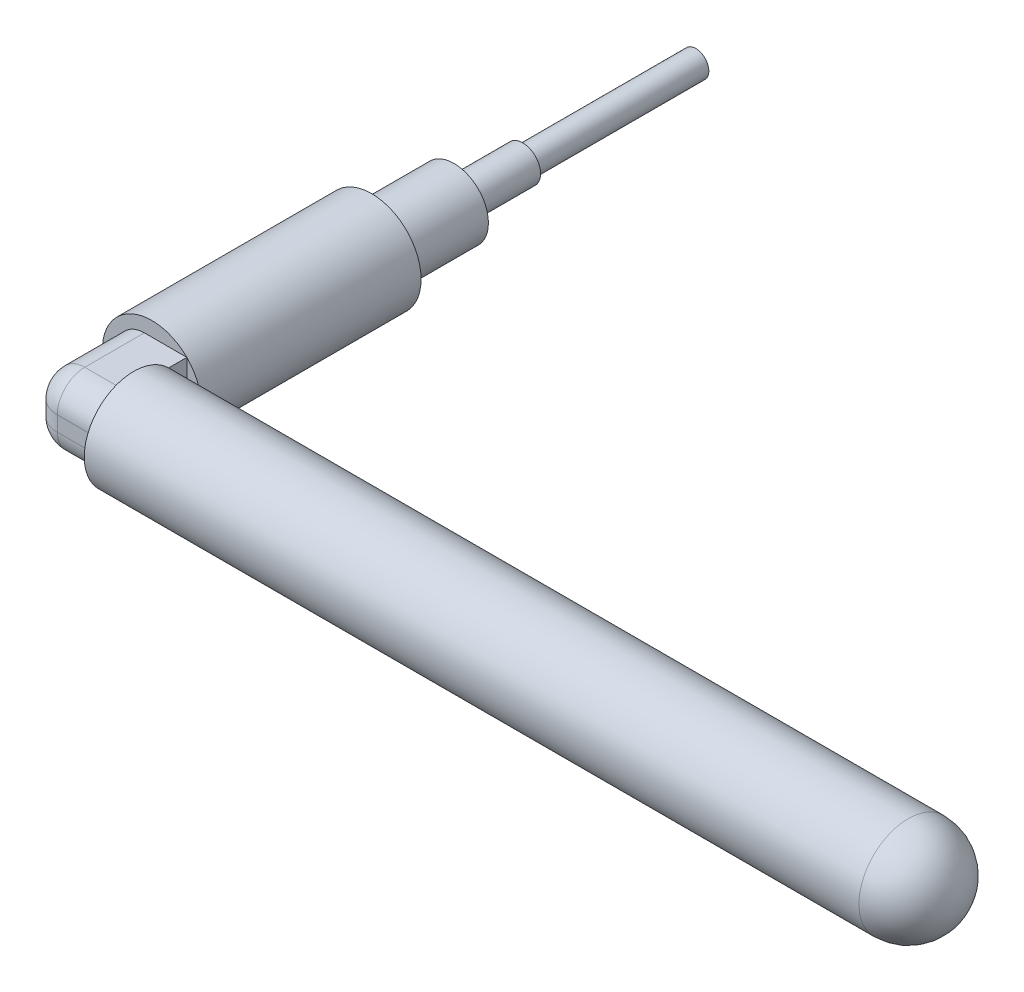
ISO-10303-21;
HEADER;
FILE_DESCRIPTION(('STEP AP214'),'2;1');
FILE_NAME('part.step','',(''),(''),'','','');
FILE_SCHEMA(('AUTOMOTIVE_DESIGN { 1 0 10303 214 1 1 1 1 }'));
ENDSEC;
DATA;
#1=APPLICATION_CONTEXT('core data for automotive mechanical design processes');
#2=APPLICATION_PROTOCOL_DEFINITION('international standard','automotive_design',2000,#1);
#3=PRODUCT_CONTEXT('',#1,'mechanical');
#4=PRODUCT('Part','Part','',(#3));
#5=PRODUCT_RELATED_PRODUCT_CATEGORY('part','',(#4));
#6=PRODUCT_DEFINITION_FORMATION('','',#4);
#7=PRODUCT_DEFINITION_CONTEXT('part definition',#1,'design');
#8=PRODUCT_DEFINITION('design','',#6,#7);
#9=PRODUCT_DEFINITION_SHAPE('','',#8);
#10=(LENGTH_UNIT() NAMED_UNIT(*) SI_UNIT(.MILLI.,.METRE.));
#11=(NAMED_UNIT(*) PLANE_ANGLE_UNIT() SI_UNIT($,.RADIAN.));
#12=(NAMED_UNIT(*) SI_UNIT($,.STERADIAN.) SOLID_ANGLE_UNIT());
#13=UNCERTAINTY_MEASURE_WITH_UNIT(LENGTH_MEASURE(1.E-05),#10,'distance_accuracy_value','');
#14=(GEOMETRIC_REPRESENTATION_CONTEXT(3) GLOBAL_UNCERTAINTY_ASSIGNED_CONTEXT((#13)) GLOBAL_UNIT_ASSIGNED_CONTEXT((#10,
#11,#12)) REPRESENTATION_CONTEXT('',''));
#15=CARTESIAN_POINT('',(0.,0.,0.));
#16=DIRECTION('',(0.,0.,1.));
#17=DIRECTION('',(1.,0.,0.));
#18=AXIS2_PLACEMENT_3D('',#15,#16,#17);
#19=CARTESIAN_POINT('',(3.23289220358494,-3.23289220358492,28.3718));
#20=DIRECTION('',(-1.,0.,0.));
#21=DIRECTION('',(0.,-1.,0.));
#22=AXIS2_PLACEMENT_3D('',#19,#20,#21);
#23=PLANE('',#22);
#24=CARTESIAN_POINT('',(3.23289220358492,0.,25.2349));
#25=DIRECTION('',(1.,0.,0.));
#26=DIRECTION('',(0.,1.,0.));
#27=AXIS2_PLACEMENT_3D('',#24,#25,#26);
#28=CIRCLE('',#27,4.572);
#29=CARTESIAN_POINT('',(3.23289220358494,-3.23289220358492,22.0020077964152));
#30=VERTEX_POINT('',#29);
#31=CARTESIAN_POINT('',(3.2328922035849,3.23289220358492,22.0020077964151));
#32=VERTEX_POINT('',#31);
#33=EDGE_CURVE('E128',#30,#32,#28,.T.);
#34=ORIENTED_EDGE('',*,*,#33,.F.);
#35=DIRECTION('',(0.,0.,-1.));
#36=VECTOR('',#35,1.);
#37=CARTESIAN_POINT('',(3.23289220358494,-3.23289220358492,28.3718));
#38=LINE('',#37,#36);
#39=CARTESIAN_POINT('',(3.23289220358487,-3.23289220358492,20.32));
#40=VERTEX_POINT('',#39);
#41=EDGE_CURVE('E123',#30,#40,#38,.T.);
#42=ORIENTED_EDGE('',*,*,#41,.T.);
#43=DIRECTION('',(0.,1.,0.));
#44=VECTOR('',#43,1.);
#45=CARTESIAN_POINT('',(3.23289220358494,-3.23289220358492,20.32));
#46=LINE('',#45,#44);
#47=CARTESIAN_POINT('',(3.23289220358487,3.23289220358492,20.32));
#48=VERTEX_POINT('',#47);
#49=EDGE_CURVE('E175',#40,#48,#46,.T.);
#50=ORIENTED_EDGE('',*,*,#49,.T.);
#51=DIRECTION('',(0.,0.,-1.));
#52=VECTOR('',#51,1.);
#53=CARTESIAN_POINT('',(3.2328922035849,3.23289220358492,28.3718));
#54=LINE('',#53,#52);
#55=EDGE_CURVE('E122',#32,#48,#54,.T.);
#56=ORIENTED_EDGE('',*,*,#55,.F.);
#57=EDGE_LOOP('',(#34,#42,#50,#56));
#58=FACE_BOUND('',#57,.T.);
#59=ADVANCED_FACE('F33',(#58),#23,.F.);
#60=CARTESIAN_POINT('',(0.,0.,20.32));
#61=DIRECTION('',(0.,0.,1.));
#62=DIRECTION('',(1.,0.,0.));
#63=AXIS2_PLACEMENT_3D('',#60,#61,#62);
#64=PLANE('',#63);
#65=ORIENTED_EDGE('',*,*,#49,.F.);
#66=CARTESIAN_POINT('',(0.,0.,20.32));
#67=DIRECTION('',(0.,0.,1.));
#68=DIRECTION('',(1.,0.,0.));
#69=AXIS2_PLACEMENT_3D('',#66,#67,#68);
#70=CIRCLE('',#69,4.572);
#71=EDGE_CURVE('E167',#40,#48,#70,.T.);
#72=ORIENTED_EDGE('',*,*,#71,.T.);
#73=EDGE_LOOP('',(#65,#72));
#74=FACE_BOUND('',#73,.T.);
#75=ADVANCED_FACE('F248',(#74),#64,.T.);
#76=DIRECTION('',(1.,0.,0.));
#77=VECTOR('',#76,1.);
#78=CARTESIAN_POINT('',(3.23289220358494,-3.23289220358492,20.32));
#79=LINE('',#78,#77);
#80=CARTESIAN_POINT('',(-0.692892203584919,-3.2328922035849,20.32));
#81=VERTEX_POINT('',#80);
#82=EDGE_CURVE('E138',#81,#40,#79,.T.);
#83=ORIENTED_EDGE('',*,*,#82,.F.);
#84=CARTESIAN_POINT('',(-0.692892203584903,-0.692892203584898,20.32));
#85=DIRECTION('',(0.,0.,1.));
#86=DIRECTION('',(1.,0.,0.));
#87=AXIS2_PLACEMENT_3D('',#84,#85,#86);
#88=CIRCLE('',#87,2.54);
#89=CARTESIAN_POINT('',(-3.2328922035849,-0.692892203584894,20.32));
#90=VERTEX_POINT('',#89);
#91=EDGE_CURVE('E197',#81,#90,#88,.F.);
#92=ORIENTED_EDGE('',*,*,#91,.T.);
#93=DIRECTION('',(0.,-1.,0.));
#94=VECTOR('',#93,1.);
#95=CARTESIAN_POINT('',(-3.23289220358491,-3.23289220358488,20.32));
#96=LINE('',#95,#94);
#97=CARTESIAN_POINT('',(-3.2328922035849,0.6928922035849,20.32));
#98=VERTEX_POINT('',#97);
#99=EDGE_CURVE('E58',#98,#90,#96,.T.);
#100=ORIENTED_EDGE('',*,*,#99,.F.);
#101=CARTESIAN_POINT('',(-0.692892203584901,0.692892203584898,20.32));
#102=DIRECTION('',(0.,0.,1.));
#103=DIRECTION('',(1.,0.,0.));
#104=AXIS2_PLACEMENT_3D('',#101,#102,#103);
#105=CIRCLE('',#104,2.54);
#106=CARTESIAN_POINT('',(-0.692892203584915,3.2328922035849,20.32));
#107=VERTEX_POINT('',#106);
#108=EDGE_CURVE('E42',#98,#107,#105,.F.);
#109=ORIENTED_EDGE('',*,*,#108,.T.);
#110=DIRECTION('',(-1.,0.,0.));
#111=VECTOR('',#110,1.);
#112=CARTESIAN_POINT('',(3.2328922035849,3.23289220358492,20.32));
#113=LINE('',#112,#111);
#114=EDGE_CURVE('E50',#48,#107,#113,.T.);
#115=ORIENTED_EDGE('',*,*,#114,.F.);
#116=CARTESIAN_POINT('',(-3.2328922035849,3.23289220358488,20.32));
#117=VERTEX_POINT('',#116);
#118=EDGE_CURVE('E163',#48,#117,#70,.T.);
#119=ORIENTED_EDGE('',*,*,#118,.T.);
#120=CARTESIAN_POINT('',(-3.23289220358491,-3.23289220358488,20.32));
#121=VERTEX_POINT('',#120);
#122=EDGE_CURVE('E166',#117,#121,#70,.T.);
#123=ORIENTED_EDGE('',*,*,#122,.T.);
#124=EDGE_CURVE('E255',#121,#40,#70,.T.);
#125=ORIENTED_EDGE('',*,*,#124,.T.);
#126=EDGE_LOOP('',(#83,#92,#100,#109,#115,#119,#123,#125));
#127=FACE_BOUND('',#126,.T.);
#128=ADVANCED_FACE('F240',(#127),#64,.T.);
#129=CARTESIAN_POINT('',(0.,0.,-13.97));
#130=DIRECTION('',(0.,0.,-1.));
#131=DIRECTION('',(-1.,0.,0.));
#132=AXIS2_PLACEMENT_3D('',#129,#130,#131);
#133=PLANE('',#132);
#134=CARTESIAN_POINT('',(0.,0.,-13.97));
#135=DIRECTION('',(0.,0.,-1.));
#136=DIRECTION('',(-1.,0.,0.));
#137=AXIS2_PLACEMENT_3D('',#134,#135,#136);
#138=CIRCLE('',#137,1.651);
#139=CARTESIAN_POINT('',(-1.651,0.,-13.97));
#140=VERTEX_POINT('',#139);
#141=EDGE_CURVE('E154',#140,#140,#138,.T.);
#142=ORIENTED_EDGE('',*,*,#141,.T.);
#143=EDGE_LOOP('',(#142));
#144=FACE_BOUND('',#143,.T.);
#145=CARTESIAN_POINT('',(0.,0.,-13.97));
#146=DIRECTION('',(0.,0.,-1.));
#147=DIRECTION('',(-1.,0.,0.));
#148=AXIS2_PLACEMENT_3D('',#145,#146,#147);
#149=CIRCLE('',#148,1.2065);
#150=CARTESIAN_POINT('',(-1.2065,0.,-13.97));
#151=VERTEX_POINT('',#150);
#152=EDGE_CURVE('E147',#151,#151,#149,.T.);
#153=ORIENTED_EDGE('',*,*,#152,.F.);
#154=EDGE_LOOP('',(#153));
#155=FACE_BOUND('',#154,.T.);
#156=ADVANCED_FACE('F285',(#144,#155),#133,.T.);
#157=CARTESIAN_POINT('',(0.,0.,-7.62));
#158=DIRECTION('',(0.,0.,-1.));
#159=DIRECTION('',(-1.,0.,0.));
#160=AXIS2_PLACEMENT_3D('',#157,#158,#159);
#161=PLANE('',#160);
#162=CARTESIAN_POINT('',(0.,0.,-7.62));
#163=DIRECTION('',(0.,0.,-1.));
#164=DIRECTION('',(-1.,0.,0.));
#165=AXIS2_PLACEMENT_3D('',#162,#163,#164);
#166=CIRCLE('',#165,3.175);
#167=CARTESIAN_POINT('',(-3.175,0.,-7.62));
#168=VERTEX_POINT('',#167);
#169=EDGE_CURVE('E157',#168,#168,#166,.T.);
#170=ORIENTED_EDGE('',*,*,#169,.T.);
#171=EDGE_LOOP('',(#170));
#172=FACE_BOUND('',#171,.T.);
#173=CARTESIAN_POINT('',(0.,0.,-7.62));
#174=DIRECTION('',(0.,0.,-1.));
#175=DIRECTION('',(-1.,0.,0.));
#176=AXIS2_PLACEMENT_3D('',#173,#174,#175);
#177=CIRCLE('',#176,1.651);
#178=CARTESIAN_POINT('',(-1.651,0.,-7.62));
#179=VERTEX_POINT('',#178);
#180=EDGE_CURVE('E151',#179,#179,#177,.T.);
#181=ORIENTED_EDGE('',*,*,#180,.F.);
#182=EDGE_LOOP('',(#181));
#183=FACE_BOUND('',#182,.T.);
#184=ADVANCED_FACE('F288',(#172,#183),#161,.T.);
#185=CARTESIAN_POINT('',(0.,0.,0.));
#186=DIRECTION('',(0.,0.,1.));
#187=DIRECTION('',(1.,0.,0.));
#188=AXIS2_PLACEMENT_3D('',#185,#186,#187);
#189=PLANE('',#188);
#190=CARTESIAN_POINT('',(0.,0.,0.));
#191=DIRECTION('',(0.,0.,1.));
#192=DIRECTION('',(1.,0.,0.));
#193=AXIS2_PLACEMENT_3D('',#190,#191,#192);
#194=CIRCLE('',#193,4.572);
#195=CARTESIAN_POINT('',(4.572,0.,0.));
#196=VERTEX_POINT('',#195);
#197=EDGE_CURVE('E162',#196,#196,#194,.T.);
#198=ORIENTED_EDGE('',*,*,#197,.F.);
#199=EDGE_LOOP('',(#198));
#200=FACE_BOUND('',#199,.T.);
#201=CARTESIAN_POINT('',(0.,0.,0.));
#202=DIRECTION('',(0.,0.,1.));
#203=DIRECTION('',(1.,0.,0.));
#204=AXIS2_PLACEMENT_3D('',#201,#202,#203);
#205=CIRCLE('',#204,3.175);
#206=CARTESIAN_POINT('',(3.175,0.,0.));
#207=VERTEX_POINT('',#206);
#208=EDGE_CURVE('E165',#207,#207,#205,.F.);
#209=ORIENTED_EDGE('',*,*,#208,.F.);
#210=EDGE_LOOP('',(#209));
#211=FACE_BOUND('',#210,.T.);
#212=ADVANCED_FACE('F296',(#200,#211),#189,.F.);
#213=CARTESIAN_POINT('',(0.,0.,20.32));
#214=DIRECTION('',(0.,0.,-1.));
#215=DIRECTION('',(-1.,0.,0.));
#216=AXIS2_PLACEMENT_3D('',#213,#214,#215);
#217=CYLINDRICAL_SURFACE('',#216,4.572);
#218=ORIENTED_EDGE('',*,*,#118,.F.);
#219=ORIENTED_EDGE('',*,*,#71,.F.);
#220=ORIENTED_EDGE('',*,*,#124,.F.);
#221=ORIENTED_EDGE('',*,*,#122,.F.);
#222=EDGE_LOOP('',(#218,#219,#220,#221));
#223=FACE_BOUND('',#222,.T.);
#224=ORIENTED_EDGE('',*,*,#197,.T.);
#225=EDGE_LOOP('',(#224));
#226=FACE_BOUND('',#225,.T.);
#227=ADVANCED_FACE('F252',(#223,#226),#217,.T.);
#228=CARTESIAN_POINT('',(0.,0.,-7.62));
#229=DIRECTION('',(0.,0.,1.));
#230=DIRECTION('',(1.,0.,0.));
#231=AXIS2_PLACEMENT_3D('',#228,#229,#230);
#232=CYLINDRICAL_SURFACE('',#231,3.175);
#233=ORIENTED_EDGE('',*,*,#169,.F.);
#234=EDGE_LOOP('',(#233));
#235=FACE_BOUND('',#234,.T.);
#236=ORIENTED_EDGE('',*,*,#208,.T.);
#237=EDGE_LOOP('',(#236));
#238=FACE_BOUND('',#237,.T.);
#239=ADVANCED_FACE('F292',(#235,#238),#232,.T.);
#240=CARTESIAN_POINT('',(0.,0.,-13.97));
#241=DIRECTION('',(0.,0.,1.));
#242=DIRECTION('',(1.,0.,0.));
#243=AXIS2_PLACEMENT_3D('',#240,#241,#242);
#244=CYLINDRICAL_SURFACE('',#243,1.651);
#245=ORIENTED_EDGE('',*,*,#141,.F.);
#246=EDGE_LOOP('',(#245));
#247=FACE_BOUND('',#246,.T.);
#248=ORIENTED_EDGE('',*,*,#180,.T.);
#249=EDGE_LOOP('',(#248));
#250=FACE_BOUND('',#249,.T.);
#251=ADVANCED_FACE('F283',(#247,#250),#244,.T.);
#252=CARTESIAN_POINT('',(0.,0.,-29.972));
#253=DIRECTION('',(0.,0.,1.));
#254=DIRECTION('',(1.,0.,0.));
#255=AXIS2_PLACEMENT_3D('',#252,#253,#254);
#256=CYLINDRICAL_SURFACE('',#255,1.2065);
#257=CARTESIAN_POINT('',(0.,0.,-29.972));
#258=DIRECTION('',(0.,0.,-1.));
#259=DIRECTION('',(-1.,0.,0.));
#260=AXIS2_PLACEMENT_3D('',#257,#258,#259);
#261=CIRCLE('',#260,1.2065);
#262=CARTESIAN_POINT('',(-1.2065,0.,-29.972));
#263=VERTEX_POINT('',#262);
#264=EDGE_CURVE('E148',#263,#263,#261,.T.);
#265=ORIENTED_EDGE('',*,*,#264,.F.);
#266=EDGE_LOOP('',(#265));
#267=FACE_BOUND('',#266,.T.);
#268=ORIENTED_EDGE('',*,*,#152,.T.);
#269=EDGE_LOOP('',(#268));
#270=FACE_BOUND('',#269,.T.);
#271=ADVANCED_FACE('F279',(#267,#270),#256,.T.);
#272=CARTESIAN_POINT('',(0.,0.,-29.972));
#273=DIRECTION('',(0.,0.,-1.));
#274=DIRECTION('',(-1.,0.,0.));
#275=AXIS2_PLACEMENT_3D('',#272,#273,#274);
#276=PLANE('',#275);
#277=ORIENTED_EDGE('',*,*,#264,.T.);
#278=EDGE_LOOP('',(#277));
#279=FACE_BOUND('',#278,.T.);
#280=ADVANCED_FACE('F268',(#279),#276,.T.);
#281=CARTESIAN_POINT('',(3.2328922035849,3.23289220358492,28.3718));
#282=DIRECTION('',(0.,-1.,0.));
#283=DIRECTION('',(1.,0.,0.));
#284=AXIS2_PLACEMENT_3D('',#281,#282,#283);
#285=PLANE('',#284);
#286=ORIENTED_EDGE('',*,*,#114,.T.);
#287=DIRECTION('',(0.,0.,-1.));
#288=VECTOR('',#287,1.);
#289=CARTESIAN_POINT('',(-0.692892203584916,3.2328922035849,28.3718));
#290=LINE('',#289,#288);
#291=CARTESIAN_POINT('',(-0.692892203584916,3.2328922035849,25.8318));
#292=VERTEX_POINT('',#291);
#293=EDGE_CURVE('E194',#107,#292,#290,.F.);
#294=ORIENTED_EDGE('',*,*,#293,.T.);
#295=DIRECTION('',(-1.,0.,0.));
#296=VECTOR('',#295,1.);
#297=CARTESIAN_POINT('',(3.2328922035849,3.23289220358492,25.8318));
#298=LINE('',#297,#296);
#299=CARTESIAN_POINT('',(3.2328922035849,3.23289220358492,25.8318));
#300=VERTEX_POINT('',#299);
#301=EDGE_CURVE('E192',#292,#300,#298,.F.);
#302=ORIENTED_EDGE('',*,*,#301,.T.);
#303=EDGE_CURVE('E145',#300,#32,#54,.T.);
#304=ORIENTED_EDGE('',*,*,#303,.T.);
#305=ORIENTED_EDGE('',*,*,#55,.T.);
#306=EDGE_LOOP('',(#286,#294,#302,#304,#305));
#307=FACE_BOUND('',#306,.T.);
#308=ADVANCED_FACE('F237',(#307),#285,.F.);
#309=CARTESIAN_POINT('',(-3.23289220358491,-3.23289220358488,28.3718));
#310=DIRECTION('',(1.,0.,0.));
#311=DIRECTION('',(0.,1.,0.));
#312=AXIS2_PLACEMENT_3D('',#309,#310,#311);
#313=PLANE('',#312);
#314=ORIENTED_EDGE('',*,*,#99,.T.);
#315=DIRECTION('',(0.,0.,-1.));
#316=VECTOR('',#315,1.);
#317=CARTESIAN_POINT('',(-3.2328922035849,-0.692892203584893,28.3718));
#318=LINE('',#317,#316);
#319=CARTESIAN_POINT('',(-3.2328922035849,-0.692892203584894,25.8318));
#320=VERTEX_POINT('',#319);
#321=EDGE_CURVE('E190',#90,#320,#318,.F.);
#322=ORIENTED_EDGE('',*,*,#321,.T.);
#323=DIRECTION('',(0.,-1.,0.));
#324=VECTOR('',#323,1.);
#325=CARTESIAN_POINT('',(-3.2328922035849,3.23289220358488,25.8318));
#326=LINE('',#325,#324);
#327=CARTESIAN_POINT('',(-3.2328922035849,0.692892203584902,25.8318));
#328=VERTEX_POINT('',#327);
#329=EDGE_CURVE('E186',#320,#328,#326,.F.);
#330=ORIENTED_EDGE('',*,*,#329,.T.);
#331=DIRECTION('',(0.,0.,-1.));
#332=VECTOR('',#331,1.);
#333=CARTESIAN_POINT('',(-3.2328922035849,0.692892203584902,28.3718));
#334=LINE('',#333,#332);
#335=EDGE_CURVE('E188',#328,#98,#334,.T.);
#336=ORIENTED_EDGE('',*,*,#335,.T.);
#337=EDGE_LOOP('',(#314,#322,#330,#336));
#338=FACE_BOUND('',#337,.T.);
#339=ADVANCED_FACE('F260',(#338),#313,.F.);
#340=CARTESIAN_POINT('',(3.23289220358494,-3.23289220358492,28.3718));
#341=DIRECTION('',(0.,1.,0.));
#342=DIRECTION('',(-1.,0.,0.));
#343=AXIS2_PLACEMENT_3D('',#340,#341,#342);
#344=PLANE('',#343);
#345=CARTESIAN_POINT('',(3.23289220358494,-3.23289220358492,25.8318));
#346=VERTEX_POINT('',#345);
#347=EDGE_CURVE('E111',#346,#30,#38,.T.);
#348=ORIENTED_EDGE('',*,*,#347,.F.);
#349=DIRECTION('',(1.,0.,0.));
#350=VECTOR('',#349,1.);
#351=CARTESIAN_POINT('',(-3.23289220358491,-3.23289220358488,25.8318));
#352=LINE('',#351,#350);
#353=CARTESIAN_POINT('',(-0.692892203584919,-3.2328922035849,25.8318));
#354=VERTEX_POINT('',#353);
#355=EDGE_CURVE('E184',#346,#354,#352,.F.);
#356=ORIENTED_EDGE('',*,*,#355,.T.);
#357=DIRECTION('',(0.,0.,-1.));
#358=VECTOR('',#357,1.);
#359=CARTESIAN_POINT('',(-0.692892203584919,-3.2328922035849,28.3718));
#360=LINE('',#359,#358);
#361=EDGE_CURVE('E182',#354,#81,#360,.T.);
#362=ORIENTED_EDGE('',*,*,#361,.T.);
#363=ORIENTED_EDGE('',*,*,#82,.T.);
#364=ORIENTED_EDGE('',*,*,#41,.F.);
#365=EDGE_LOOP('',(#348,#356,#362,#363,#364));
#366=FACE_BOUND('',#365,.T.);
#367=ADVANCED_FACE('F136',(#366),#344,.F.);
#368=CARTESIAN_POINT('',(0.,0.,28.3718));
#369=DIRECTION('',(0.,0.,1.));
#370=DIRECTION('',(1.,0.,0.));
#371=AXIS2_PLACEMENT_3D('',#368,#369,#370);
#372=PLANE('',#371);
#373=DIRECTION('',(0.,-1.,0.));
#374=VECTOR('',#373,1.);
#375=CARTESIAN_POINT('',(-0.692892203584907,-3.23289220358489,28.3718));
#376=LINE('',#375,#374);
#377=CARTESIAN_POINT('',(-0.692892203584901,0.692892203584898,28.3718));
#378=VERTEX_POINT('',#377);
#379=CARTESIAN_POINT('',(-0.692892203584903,-0.692892203584898,28.3718));
#380=VERTEX_POINT('',#379);
#381=EDGE_CURVE('E172',#378,#380,#376,.T.);
#382=ORIENTED_EDGE('',*,*,#381,.T.);
#383=DIRECTION('',(1.,0.,0.));
#384=VECTOR('',#383,1.);
#385=CARTESIAN_POINT('',(3.23289220358495,-0.692892203584921,28.3718));
#386=LINE('',#385,#384);
#387=CARTESIAN_POINT('',(3.23289220358492,-0.692892203584922,28.3718));
#388=VERTEX_POINT('',#387);
#389=EDGE_CURVE('E179',#380,#388,#386,.T.);
#390=ORIENTED_EDGE('',*,*,#389,.T.);
#391=DIRECTION('',(0.,1.,0.));
#392=VECTOR('',#391,1.);
#393=CARTESIAN_POINT('',(3.23289220358494,-3.23289220358492,28.3718));
#394=LINE('',#393,#392);
#395=CARTESIAN_POINT('',(3.23289220358491,0.69289220358492,28.3718));
#396=VERTEX_POINT('',#395);
#397=EDGE_CURVE('E139',#388,#396,#394,.T.);
#398=ORIENTED_EDGE('',*,*,#397,.T.);
#399=DIRECTION('',(-1.,0.,0.));
#400=VECTOR('',#399,1.);
#401=CARTESIAN_POINT('',(-3.23289220358488,0.692892203584883,28.3718));
#402=LINE('',#401,#400);
#403=EDGE_CURVE('E177',#396,#378,#402,.T.);
#404=ORIENTED_EDGE('',*,*,#403,.T.);
#405=EDGE_LOOP('',(#382,#390,#398,#404));
#406=FACE_BOUND('',#405,.T.);
#407=ADVANCED_FACE('F230',(#406),#372,.T.);
#408=CARTESIAN_POINT('',(3.23289220358492,0.,25.2349));
#409=DIRECTION('',(1.,0.,0.));
#410=DIRECTION('',(0.,1.,0.));
#411=AXIS2_PLACEMENT_3D('',#408,#409,#410);
#412=PLANE('',#411);
#413=EDGE_CURVE('E115',#32,#30,#28,.T.);
#414=ORIENTED_EDGE('',*,*,#413,.F.);
#415=ORIENTED_EDGE('',*,*,#303,.F.);
#416=CARTESIAN_POINT('',(3.23289220358491,0.692892203584921,25.8318));
#417=DIRECTION('',(1.,0.,0.));
#418=DIRECTION('',(0.,1.,0.));
#419=AXIS2_PLACEMENT_3D('',#416,#417,#418);
#420=CIRCLE('',#419,2.54);
#421=EDGE_CURVE('E11',#300,#396,#420,.T.);
#422=ORIENTED_EDGE('',*,*,#421,.T.);
#423=ORIENTED_EDGE('',*,*,#397,.F.);
#424=CARTESIAN_POINT('',(3.23289220358492,-0.692892203584921,25.8318));
#425=DIRECTION('',(1.,0.,0.));
#426=DIRECTION('',(0.,1.,0.));
#427=AXIS2_PLACEMENT_3D('',#424,#425,#426);
#428=CIRCLE('',#427,2.54);
#429=EDGE_CURVE('E118',#388,#346,#428,.T.);
#430=ORIENTED_EDGE('',*,*,#429,.T.);
#431=ORIENTED_EDGE('',*,*,#347,.T.);
#432=EDGE_LOOP('',(#414,#415,#422,#423,#430,#431));
#433=FACE_BOUND('',#432,.T.);
#434=ADVANCED_FACE('F113',(#433),#412,.F.);
#435=CARTESIAN_POINT('',(74.8608922035849,4.46883222802675E-13,25.2349));
#436=DIRECTION('',(-1.,0.,0.));
#437=DIRECTION('',(0.,-1.,0.));
#438=AXIS2_PLACEMENT_3D('',#435,#436,#437);
#439=CYLINDRICAL_SURFACE('',#438,4.572);
#440=CARTESIAN_POINT('',(74.8608922035849,4.46883222802675E-13,25.2349));
#441=DIRECTION('',(1.,0.,0.));
#442=DIRECTION('',(0.,1.,0.));
#443=AXIS2_PLACEMENT_3D('',#440,#441,#442);
#444=CIRCLE('',#443,4.572);
#445=CARTESIAN_POINT('',(74.8608922035849,4.57200000000045,25.2349));
#446=VERTEX_POINT('',#445);
#447=EDGE_CURVE('E135',#446,#446,#444,.T.);
#448=ORIENTED_EDGE('',*,*,#447,.F.);
#449=EDGE_LOOP('',(#448));
#450=FACE_BOUND('',#449,.T.);
#451=ORIENTED_EDGE('',*,*,#33,.T.);
#452=ORIENTED_EDGE('',*,*,#413,.T.);
#453=EDGE_LOOP('',(#451,#452));
#454=FACE_BOUND('',#453,.T.);
#455=ADVANCED_FACE('F127',(#450,#454),#439,.T.);
#456=CARTESIAN_POINT('',(74.8608922035849,4.46883222802675E-13,25.2349));
#457=DIRECTION('',(0.,0.,1.));
#458=DIRECTION('',(1.,0.,0.));
#459=AXIS2_PLACEMENT_3D('',#456,#457,#458);
#460=SPHERICAL_SURFACE('',#459,4.572);
#461=CARTESIAN_POINT('',(74.8608922035849,4.46883222802675E-13,25.2349));
#462=DIRECTION('',(1.,0.,0.));
#463=DIRECTION('',(0.,1.,0.));
#464=AXIS2_PLACEMENT_3D('',#461,#462,#463);
#465=SPHERICAL_SURFACE('',#464,4.572);
#466=ORIENTED_EDGE('',*,*,#447,.T.);
#467=EDGE_LOOP('',(#466));
#468=FACE_BOUND('',#467,.T.);
#469=ADVANCED_FACE('F306',(#468),#465,.T.);
#470=CARTESIAN_POINT('',(-0.692892203584901,0.692892203584898,28.3718));
#471=DIRECTION('',(0.,0.,-1.));
#472=DIRECTION('',(-1.,0.,0.));
#473=AXIS2_PLACEMENT_3D('',#470,#471,#472);
#474=CYLINDRICAL_SURFACE('',#473,2.54);
#475=ORIENTED_EDGE('',*,*,#108,.F.);
#476=ORIENTED_EDGE('',*,*,#335,.F.);
#477=CARTESIAN_POINT('',(-0.692892203584901,0.692892203584898,25.8318));
#478=DIRECTION('',(0.,0.,1.));
#479=DIRECTION('',(1.,0.,0.));
#480=AXIS2_PLACEMENT_3D('',#477,#478,#479);
#481=CIRCLE('',#480,2.54);
#482=EDGE_CURVE('E37',#292,#328,#481,.T.);
#483=ORIENTED_EDGE('',*,*,#482,.F.);
#484=ORIENTED_EDGE('',*,*,#293,.F.);
#485=EDGE_LOOP('',(#475,#476,#483,#484));
#486=FACE_BOUND('',#485,.T.);
#487=ADVANCED_FACE('F35',(#486),#474,.T.);
#488=CARTESIAN_POINT('',(0.,0.692892203584902,25.8318));
#489=DIRECTION('',(1.,0.,0.));
#490=DIRECTION('',(0.,1.,0.));
#491=AXIS2_PLACEMENT_3D('',#488,#489,#490);
#492=CYLINDRICAL_SURFACE('',#491,2.54);
#493=ORIENTED_EDGE('',*,*,#421,.F.);
#494=ORIENTED_EDGE('',*,*,#301,.F.);
#495=CARTESIAN_POINT('',(-0.692892203584901,0.692892203584898,25.8318));
#496=DIRECTION('',(-1.,0.,0.));
#497=DIRECTION('',(0.,-1.,0.));
#498=AXIS2_PLACEMENT_3D('',#495,#496,#497);
#499=CIRCLE('',#498,2.54);
#500=EDGE_CURVE('E211',#378,#292,#499,.T.);
#501=ORIENTED_EDGE('',*,*,#500,.F.);
#502=ORIENTED_EDGE('',*,*,#403,.F.);
#503=EDGE_LOOP('',(#493,#494,#501,#502));
#504=FACE_BOUND('',#503,.T.);
#505=ADVANCED_FACE('F236',(#504),#492,.T.);
#506=CARTESIAN_POINT('',(-0.692892203584901,0.692892203584898,25.8318));
#507=DIRECTION('',(0.,0.,1.));
#508=DIRECTION('',(1.,0.,0.));
#509=AXIS2_PLACEMENT_3D('',#506,#507,#508);
#510=SPHERICAL_SURFACE('',#509,2.54);
#511=ORIENTED_EDGE('',*,*,#500,.T.);
#512=ORIENTED_EDGE('',*,*,#482,.T.);
#513=CARTESIAN_POINT('',(-0.692892203584901,0.692892203584898,25.8318));
#514=DIRECTION('',(0.,1.,0.));
#515=DIRECTION('',(-1.,0.,0.));
#516=AXIS2_PLACEMENT_3D('',#513,#514,#515);
#517=CIRCLE('',#516,2.54);
#518=EDGE_CURVE('E209',#378,#328,#517,.F.);
#519=ORIENTED_EDGE('',*,*,#518,.F.);
#520=EDGE_LOOP('',(#511,#512,#519));
#521=FACE_BOUND('',#520,.T.);
#522=ADVANCED_FACE('F218',(#521),#510,.T.);
#523=CARTESIAN_POINT('',(-0.692892203584903,-0.692892203584898,28.3718));
#524=DIRECTION('',(0.,0.,-1.));
#525=DIRECTION('',(-1.,0.,0.));
#526=AXIS2_PLACEMENT_3D('',#523,#524,#525);
#527=CYLINDRICAL_SURFACE('',#526,2.54);
#528=ORIENTED_EDGE('',*,*,#91,.F.);
#529=ORIENTED_EDGE('',*,*,#361,.F.);
#530=CARTESIAN_POINT('',(-0.692892203584903,-0.692892203584898,25.8318));
#531=DIRECTION('',(0.,0.,1.));
#532=DIRECTION('',(1.,0.,0.));
#533=AXIS2_PLACEMENT_3D('',#530,#531,#532);
#534=CIRCLE('',#533,2.54);
#535=EDGE_CURVE('E206',#320,#354,#534,.T.);
#536=ORIENTED_EDGE('',*,*,#535,.F.);
#537=ORIENTED_EDGE('',*,*,#321,.F.);
#538=EDGE_LOOP('',(#528,#529,#536,#537));
#539=FACE_BOUND('',#538,.T.);
#540=ADVANCED_FACE('F259',(#539),#527,.T.);
#541=CARTESIAN_POINT('',(-0.692892203584902,0.,25.8318));
#542=DIRECTION('',(0.,1.,0.));
#543=DIRECTION('',(-1.,0.,0.));
#544=AXIS2_PLACEMENT_3D('',#541,#542,#543);
#545=CYLINDRICAL_SURFACE('',#544,2.54);
#546=ORIENTED_EDGE('',*,*,#518,.T.);
#547=ORIENTED_EDGE('',*,*,#329,.F.);
#548=CARTESIAN_POINT('',(-0.692892203584903,-0.692892203584898,25.8318));
#549=DIRECTION('',(0.,-1.,0.));
#550=DIRECTION('',(1.,0.,0.));
#551=AXIS2_PLACEMENT_3D('',#548,#549,#550);
#552=CIRCLE('',#551,2.54);
#553=EDGE_CURVE('E203',#380,#320,#552,.T.);
#554=ORIENTED_EDGE('',*,*,#553,.F.);
#555=ORIENTED_EDGE('',*,*,#381,.F.);
#556=EDGE_LOOP('',(#546,#547,#554,#555));
#557=FACE_BOUND('',#556,.T.);
#558=ADVANCED_FACE('F225',(#557),#545,.T.);
#559=CARTESIAN_POINT('',(-0.692892203584903,-0.692892203584898,25.8318));
#560=DIRECTION('',(0.,0.,1.));
#561=DIRECTION('',(1.,0.,0.));
#562=AXIS2_PLACEMENT_3D('',#559,#560,#561);
#563=SPHERICAL_SURFACE('',#562,2.54);
#564=ORIENTED_EDGE('',*,*,#553,.T.);
#565=ORIENTED_EDGE('',*,*,#535,.T.);
#566=CARTESIAN_POINT('',(-0.692892203584903,-0.692892203584898,25.8318));
#567=DIRECTION('',(-1.,0.,0.));
#568=DIRECTION('',(0.,-1.,0.));
#569=AXIS2_PLACEMENT_3D('',#566,#567,#568);
#570=CIRCLE('',#569,2.54);
#571=EDGE_CURVE('E200',#380,#354,#570,.F.);
#572=ORIENTED_EDGE('',*,*,#571,.F.);
#573=EDGE_LOOP('',(#564,#565,#572));
#574=FACE_BOUND('',#573,.T.);
#575=ADVANCED_FACE('F313',(#574),#563,.T.);
#576=CARTESIAN_POINT('',(0.,-0.692892203584902,25.8318));
#577=DIRECTION('',(-1.,0.,0.));
#578=DIRECTION('',(0.,-1.,0.));
#579=AXIS2_PLACEMENT_3D('',#576,#577,#578);
#580=CYLINDRICAL_SURFACE('',#579,2.54);
#581=ORIENTED_EDGE('',*,*,#571,.T.);
#582=ORIENTED_EDGE('',*,*,#355,.F.);
#583=ORIENTED_EDGE('',*,*,#429,.F.);
#584=ORIENTED_EDGE('',*,*,#389,.F.);
#585=EDGE_LOOP('',(#581,#582,#583,#584));
#586=FACE_BOUND('',#585,.T.);
#587=ADVANCED_FACE('F310',(#586),#580,.T.);
#588=CLOSED_SHELL('',(#59,#75,#128,#156,#184,#212,#227,#239,#251,#271,#280,#308,#339,#367,#407,
#434,#455,#469,#487,#505,#522,#540,#558,#575,#587));
#589=MANIFOLD_SOLID_BREP('B2',#588);
#590=ADVANCED_BREP_SHAPE_REPRESENTATION('',(#18,#589),#14);
#591=SHAPE_DEFINITION_REPRESENTATION(#9,#590);
ENDSEC;
END-ISO-10303-21;
